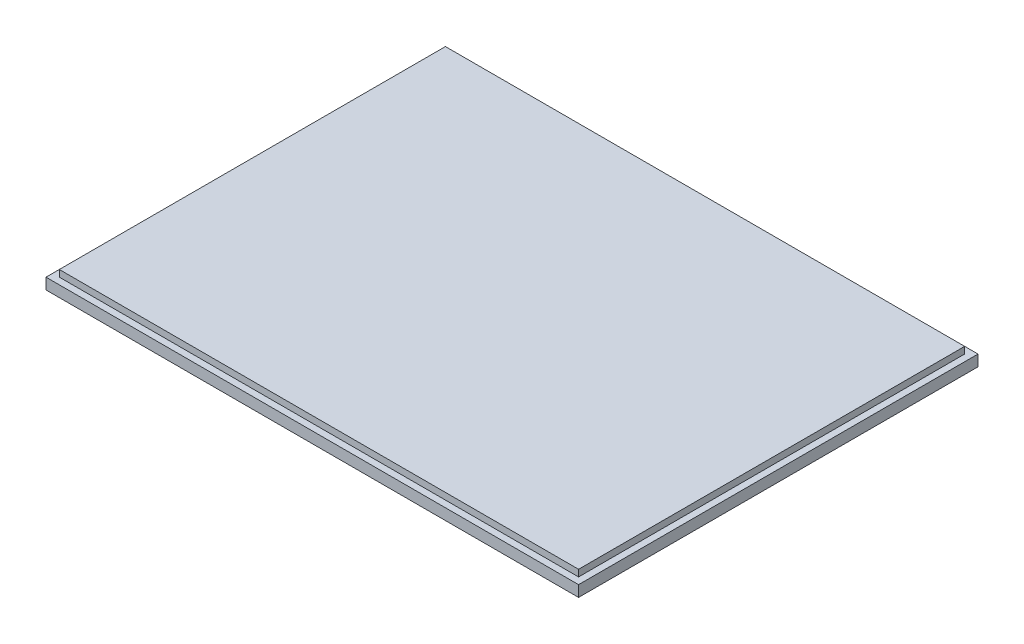
ISO-10303-21;
HEADER;
FILE_DESCRIPTION(('STEP AP214'),'2;1');
FILE_NAME('part.step','',(''),(''),'','','');
FILE_SCHEMA(('AUTOMOTIVE_DESIGN { 1 0 10303 214 1 1 1 1 }'));
ENDSEC;
DATA;
#1=APPLICATION_CONTEXT('core data for automotive mechanical design processes');
#2=APPLICATION_PROTOCOL_DEFINITION('international standard','automotive_design',2000,#1);
#3=PRODUCT_CONTEXT('',#1,'mechanical');
#4=PRODUCT('Part','Part','',(#3));
#5=PRODUCT_RELATED_PRODUCT_CATEGORY('part','',(#4));
#6=PRODUCT_DEFINITION_FORMATION('','',#4);
#7=PRODUCT_DEFINITION_CONTEXT('part definition',#1,'design');
#8=PRODUCT_DEFINITION('design','',#6,#7);
#9=PRODUCT_DEFINITION_SHAPE('','',#8);
#10=(LENGTH_UNIT() NAMED_UNIT(*) SI_UNIT(.MILLI.,.METRE.));
#11=(NAMED_UNIT(*) PLANE_ANGLE_UNIT() SI_UNIT($,.RADIAN.));
#12=(NAMED_UNIT(*) SI_UNIT($,.STERADIAN.) SOLID_ANGLE_UNIT());
#13=UNCERTAINTY_MEASURE_WITH_UNIT(LENGTH_MEASURE(1.E-05),#10,'distance_accuracy_value','');
#14=(GEOMETRIC_REPRESENTATION_CONTEXT(3) GLOBAL_UNCERTAINTY_ASSIGNED_CONTEXT((#13)) GLOBAL_UNIT_ASSIGNED_CONTEXT((#10,
#11,#12)) REPRESENTATION_CONTEXT('',''));
#15=CARTESIAN_POINT('',(0.,0.,0.));
#16=DIRECTION('',(0.,0.,1.));
#17=DIRECTION('',(1.,0.,0.));
#18=AXIS2_PLACEMENT_3D('',#15,#16,#17);
#19=CARTESIAN_POINT('',(60.,4.,-45.));
#20=DIRECTION('',(-1.,0.,0.));
#21=DIRECTION('',(0.,0.,1.));
#22=AXIS2_PLACEMENT_3D('',#19,#20,#21);
#23=PLANE('',#22);
#24=DIRECTION('',(0.,0.,-1.));
#25=VECTOR('',#24,1.);
#26=CARTESIAN_POINT('',(60.,2.5,-45.));
#27=LINE('',#26,#25);
#28=CARTESIAN_POINT('',(60.,2.5,45.));
#29=VERTEX_POINT('',#28);
#30=CARTESIAN_POINT('',(60.,2.5,-45.));
#31=VERTEX_POINT('',#30);
#32=EDGE_CURVE('E144',#29,#31,#27,.T.);
#33=ORIENTED_EDGE('',*,*,#32,.F.);
#34=DIRECTION('',(0.,-1.,0.));
#35=VECTOR('',#34,1.);
#36=CARTESIAN_POINT('',(60.,4.,45.));
#37=LINE('',#36,#35);
#38=CARTESIAN_POINT('',(60.,0.,45.));
#39=VERTEX_POINT('',#38);
#40=EDGE_CURVE('E158',#29,#39,#37,.T.);
#41=ORIENTED_EDGE('',*,*,#40,.T.);
#42=DIRECTION('',(0.,0.,-1.));
#43=VECTOR('',#42,1.);
#44=CARTESIAN_POINT('',(60.,0.,-45.));
#45=LINE('',#44,#43);
#46=CARTESIAN_POINT('',(60.,0.,-45.));
#47=VERTEX_POINT('',#46);
#48=EDGE_CURVE('E146',#39,#47,#45,.T.);
#49=ORIENTED_EDGE('',*,*,#48,.T.);
#50=DIRECTION('',(0.,-1.,0.));
#51=VECTOR('',#50,1.);
#52=CARTESIAN_POINT('',(60.,4.,-45.));
#53=LINE('',#52,#51);
#54=EDGE_CURVE('E45',#31,#47,#53,.T.);
#55=ORIENTED_EDGE('',*,*,#54,.F.);
#56=EDGE_LOOP('',(#33,#41,#49,#55));
#57=FACE_BOUND('',#56,.T.);
#58=ADVANCED_FACE('F38',(#57),#23,.F.);
#59=CARTESIAN_POINT('',(-60.,4.,-45.));
#60=DIRECTION('',(0.,0.,1.));
#61=DIRECTION('',(1.,0.,0.));
#62=AXIS2_PLACEMENT_3D('',#59,#60,#61);
#63=PLANE('',#62);
#64=DIRECTION('',(-1.,0.,0.));
#65=VECTOR('',#64,1.);
#66=CARTESIAN_POINT('',(-60.,2.5,-45.));
#67=LINE('',#66,#65);
#68=CARTESIAN_POINT('',(-60.,2.5,-45.));
#69=VERTEX_POINT('',#68);
#70=EDGE_CURVE('E142',#31,#69,#67,.T.);
#71=ORIENTED_EDGE('',*,*,#70,.F.);
#72=ORIENTED_EDGE('',*,*,#54,.T.);
#73=DIRECTION('',(-1.,0.,0.));
#74=VECTOR('',#73,1.);
#75=CARTESIAN_POINT('',(-60.,0.,-45.));
#76=LINE('',#75,#74);
#77=CARTESIAN_POINT('',(-60.,0.,-45.));
#78=VERTEX_POINT('',#77);
#79=EDGE_CURVE('E149',#47,#78,#76,.T.);
#80=ORIENTED_EDGE('',*,*,#79,.T.);
#81=DIRECTION('',(0.,-1.,0.));
#82=VECTOR('',#81,1.);
#83=CARTESIAN_POINT('',(-60.,4.,-45.));
#84=LINE('',#83,#82);
#85=EDGE_CURVE('E162',#69,#78,#84,.T.);
#86=ORIENTED_EDGE('',*,*,#85,.F.);
#87=EDGE_LOOP('',(#71,#72,#80,#86));
#88=FACE_BOUND('',#87,.T.);
#89=ADVANCED_FACE('F167',(#88),#63,.F.);
#90=CARTESIAN_POINT('',(-60.,4.,-45.));
#91=DIRECTION('',(1.,0.,0.));
#92=DIRECTION('',(0.,0.,-1.));
#93=AXIS2_PLACEMENT_3D('',#90,#91,#92);
#94=PLANE('',#93);
#95=DIRECTION('',(0.,0.,1.));
#96=VECTOR('',#95,1.);
#97=CARTESIAN_POINT('',(-60.,2.5,-45.));
#98=LINE('',#97,#96);
#99=CARTESIAN_POINT('',(-60.,2.5,45.));
#100=VERTEX_POINT('',#99);
#101=EDGE_CURVE('E51',#69,#100,#98,.T.);
#102=ORIENTED_EDGE('',*,*,#101,.F.);
#103=ORIENTED_EDGE('',*,*,#85,.T.);
#104=DIRECTION('',(0.,0.,1.));
#105=VECTOR('',#104,1.);
#106=CARTESIAN_POINT('',(-60.,0.,-45.));
#107=LINE('',#106,#105);
#108=CARTESIAN_POINT('',(-60.,0.,45.));
#109=VERTEX_POINT('',#108);
#110=EDGE_CURVE('E152',#78,#109,#107,.T.);
#111=ORIENTED_EDGE('',*,*,#110,.T.);
#112=DIRECTION('',(0.,-1.,0.));
#113=VECTOR('',#112,1.);
#114=CARTESIAN_POINT('',(-60.,4.,45.));
#115=LINE('',#114,#113);
#116=EDGE_CURVE('E160',#100,#109,#115,.T.);
#117=ORIENTED_EDGE('',*,*,#116,.F.);
#118=EDGE_LOOP('',(#102,#103,#111,#117));
#119=FACE_BOUND('',#118,.T.);
#120=ADVANCED_FACE('F181',(#119),#94,.F.);
#121=CARTESIAN_POINT('',(-60.,4.,45.));
#122=DIRECTION('',(0.,0.,-1.));
#123=DIRECTION('',(-1.,0.,0.));
#124=AXIS2_PLACEMENT_3D('',#121,#122,#123);
#125=PLANE('',#124);
#126=DIRECTION('',(1.,0.,0.));
#127=VECTOR('',#126,1.);
#128=CARTESIAN_POINT('',(-60.,2.5,45.));
#129=LINE('',#128,#127);
#130=EDGE_CURVE('E12',#100,#29,#129,.T.);
#131=ORIENTED_EDGE('',*,*,#130,.F.);
#132=ORIENTED_EDGE('',*,*,#116,.T.);
#133=DIRECTION('',(1.,0.,0.));
#134=VECTOR('',#133,1.);
#135=CARTESIAN_POINT('',(-60.,0.,45.));
#136=LINE('',#135,#134);
#137=EDGE_CURVE('E155',#109,#39,#136,.T.);
#138=ORIENTED_EDGE('',*,*,#137,.T.);
#139=ORIENTED_EDGE('',*,*,#40,.F.);
#140=EDGE_LOOP('',(#131,#132,#138,#139));
#141=FACE_BOUND('',#140,.T.);
#142=ADVANCED_FACE('F178',(#141),#125,.F.);
#143=CARTESIAN_POINT('',(0.,0.,0.));
#144=DIRECTION('',(0.,1.,0.));
#145=DIRECTION('',(0.,0.,1.));
#146=AXIS2_PLACEMENT_3D('',#143,#144,#145);
#147=PLANE('',#146);
#148=ORIENTED_EDGE('',*,*,#48,.F.);
#149=ORIENTED_EDGE('',*,*,#137,.F.);
#150=ORIENTED_EDGE('',*,*,#110,.F.);
#151=ORIENTED_EDGE('',*,*,#79,.F.);
#152=EDGE_LOOP('',(#148,#149,#150,#151));
#153=FACE_BOUND('',#152,.T.);
#154=ADVANCED_FACE('F174',(#153),#147,.F.);
#155=CARTESIAN_POINT('',(0.,2.5,0.));
#156=DIRECTION('',(0.,1.,0.));
#157=DIRECTION('',(0.,0.,1.));
#158=AXIS2_PLACEMENT_3D('',#155,#156,#157);
#159=PLANE('',#158);
#160=DIRECTION('',(1.,0.,0.));
#161=VECTOR('',#160,1.);
#162=CARTESIAN_POINT('',(-58.5,2.5,43.5));
#163=LINE('',#162,#161);
#164=CARTESIAN_POINT('',(-58.5,2.5,43.5));
#165=VERTEX_POINT('',#164);
#166=CARTESIAN_POINT('',(58.5,2.5,43.5));
#167=VERTEX_POINT('',#166);
#168=EDGE_CURVE('E113',#165,#167,#163,.T.);
#169=ORIENTED_EDGE('',*,*,#168,.F.);
#170=DIRECTION('',(0.,0.,1.));
#171=VECTOR('',#170,1.);
#172=CARTESIAN_POINT('',(-58.5,2.5,-43.5));
#173=LINE('',#172,#171);
#174=CARTESIAN_POINT('',(-58.5,2.5,-43.5));
#175=VERTEX_POINT('',#174);
#176=EDGE_CURVE('E122',#175,#165,#173,.T.);
#177=ORIENTED_EDGE('',*,*,#176,.F.);
#178=DIRECTION('',(-1.,0.,0.));
#179=VECTOR('',#178,1.);
#180=CARTESIAN_POINT('',(-58.5,2.5,-43.5));
#181=LINE('',#180,#179);
#182=CARTESIAN_POINT('',(58.5,2.5,-43.5));
#183=VERTEX_POINT('',#182);
#184=EDGE_CURVE('E105',#183,#175,#181,.T.);
#185=ORIENTED_EDGE('',*,*,#184,.F.);
#186=DIRECTION('',(0.,0.,-1.));
#187=VECTOR('',#186,1.);
#188=CARTESIAN_POINT('',(58.5,2.5,-43.5));
#189=LINE('',#188,#187);
#190=EDGE_CURVE('E119',#167,#183,#189,.T.);
#191=ORIENTED_EDGE('',*,*,#190,.F.);
#192=EDGE_LOOP('',(#169,#177,#185,#191));
#193=FACE_BOUND('',#192,.T.);
#194=ORIENTED_EDGE('',*,*,#32,.T.);
#195=ORIENTED_EDGE('',*,*,#70,.T.);
#196=ORIENTED_EDGE('',*,*,#101,.T.);
#197=ORIENTED_EDGE('',*,*,#130,.T.);
#198=EDGE_LOOP('',(#194,#195,#196,#197));
#199=FACE_BOUND('',#198,.T.);
#200=ADVANCED_FACE('F118',(#193,#199),#159,.T.);
#201=CARTESIAN_POINT('',(58.5,2.5,-43.5));
#202=DIRECTION('',(1.,0.,0.));
#203=DIRECTION('',(0.,0.,-1.));
#204=AXIS2_PLACEMENT_3D('',#201,#202,#203);
#205=PLANE('',#204);
#206=DIRECTION('',(0.,0.,-1.));
#207=VECTOR('',#206,1.);
#208=CARTESIAN_POINT('',(58.5,4.,-43.5));
#209=LINE('',#208,#207);
#210=CARTESIAN_POINT('',(58.5,4.,43.5));
#211=VERTEX_POINT('',#210);
#212=CARTESIAN_POINT('',(58.5,4.,-43.5));
#213=VERTEX_POINT('',#212);
#214=EDGE_CURVE('E133',#211,#213,#209,.T.);
#215=ORIENTED_EDGE('',*,*,#214,.F.);
#216=DIRECTION('',(0.,1.,0.));
#217=VECTOR('',#216,1.);
#218=CARTESIAN_POINT('',(58.5,2.5,43.5));
#219=LINE('',#218,#217);
#220=EDGE_CURVE('E125',#167,#211,#219,.T.);
#221=ORIENTED_EDGE('',*,*,#220,.F.);
#222=ORIENTED_EDGE('',*,*,#190,.T.);
#223=DIRECTION('',(0.,1.,0.));
#224=VECTOR('',#223,1.);
#225=CARTESIAN_POINT('',(58.5,2.5,-43.5));
#226=LINE('',#225,#224);
#227=EDGE_CURVE('E102',#183,#213,#226,.T.);
#228=ORIENTED_EDGE('',*,*,#227,.T.);
#229=EDGE_LOOP('',(#215,#221,#222,#228));
#230=FACE_BOUND('',#229,.T.);
#231=ADVANCED_FACE('F124',(#230),#205,.T.);
#232=CARTESIAN_POINT('',(-58.5,2.5,43.5));
#233=DIRECTION('',(0.,0.,1.));
#234=DIRECTION('',(1.,0.,0.));
#235=AXIS2_PLACEMENT_3D('',#232,#233,#234);
#236=PLANE('',#235);
#237=DIRECTION('',(1.,0.,0.));
#238=VECTOR('',#237,1.);
#239=CARTESIAN_POINT('',(-58.5,4.,43.5));
#240=LINE('',#239,#238);
#241=CARTESIAN_POINT('',(-58.5,4.,43.5));
#242=VERTEX_POINT('',#241);
#243=EDGE_CURVE('E126',#242,#211,#240,.T.);
#244=ORIENTED_EDGE('',*,*,#243,.F.);
#245=DIRECTION('',(0.,1.,0.));
#246=VECTOR('',#245,1.);
#247=CARTESIAN_POINT('',(-58.5,2.5,43.5));
#248=LINE('',#247,#246);
#249=EDGE_CURVE('E138',#165,#242,#248,.T.);
#250=ORIENTED_EDGE('',*,*,#249,.F.);
#251=ORIENTED_EDGE('',*,*,#168,.T.);
#252=ORIENTED_EDGE('',*,*,#220,.T.);
#253=EDGE_LOOP('',(#244,#250,#251,#252));
#254=FACE_BOUND('',#253,.T.);
#255=ADVANCED_FACE('F226',(#254),#236,.T.);
#256=CARTESIAN_POINT('',(-58.5,2.5,-43.5));
#257=DIRECTION('',(-1.,0.,0.));
#258=DIRECTION('',(0.,0.,1.));
#259=AXIS2_PLACEMENT_3D('',#256,#257,#258);
#260=PLANE('',#259);
#261=DIRECTION('',(0.,0.,1.));
#262=VECTOR('',#261,1.);
#263=CARTESIAN_POINT('',(-58.5,4.,-43.5));
#264=LINE('',#263,#262);
#265=CARTESIAN_POINT('',(-58.5,4.,-43.5));
#266=VERTEX_POINT('',#265);
#267=EDGE_CURVE('E59',#266,#242,#264,.T.);
#268=ORIENTED_EDGE('',*,*,#267,.F.);
#269=DIRECTION('',(0.,1.,0.));
#270=VECTOR('',#269,1.);
#271=CARTESIAN_POINT('',(-58.5,2.5,-43.5));
#272=LINE('',#271,#270);
#273=EDGE_CURVE('E112',#175,#266,#272,.T.);
#274=ORIENTED_EDGE('',*,*,#273,.F.);
#275=ORIENTED_EDGE('',*,*,#176,.T.);
#276=ORIENTED_EDGE('',*,*,#249,.T.);
#277=EDGE_LOOP('',(#268,#274,#275,#276));
#278=FACE_BOUND('',#277,.T.);
#279=ADVANCED_FACE('F235',(#278),#260,.T.);
#280=CARTESIAN_POINT('',(-58.5,2.5,-43.5));
#281=DIRECTION('',(0.,0.,-1.));
#282=DIRECTION('',(-1.,0.,0.));
#283=AXIS2_PLACEMENT_3D('',#280,#281,#282);
#284=PLANE('',#283);
#285=DIRECTION('',(-1.,0.,0.));
#286=VECTOR('',#285,1.);
#287=CARTESIAN_POINT('',(-58.5,4.,-43.5));
#288=LINE('',#287,#286);
#289=EDGE_CURVE('E107',#213,#266,#288,.T.);
#290=ORIENTED_EDGE('',*,*,#289,.F.);
#291=ORIENTED_EDGE('',*,*,#227,.F.);
#292=ORIENTED_EDGE('',*,*,#184,.T.);
#293=ORIENTED_EDGE('',*,*,#273,.T.);
#294=EDGE_LOOP('',(#290,#291,#292,#293));
#295=FACE_BOUND('',#294,.T.);
#296=ADVANCED_FACE('F104',(#295),#284,.T.);
#297=CARTESIAN_POINT('',(0.,4.,0.));
#298=DIRECTION('',(0.,1.,0.));
#299=DIRECTION('',(0.,0.,1.));
#300=AXIS2_PLACEMENT_3D('',#297,#298,#299);
#301=PLANE('',#300);
#302=ORIENTED_EDGE('',*,*,#243,.T.);
#303=ORIENTED_EDGE('',*,*,#214,.T.);
#304=ORIENTED_EDGE('',*,*,#289,.T.);
#305=ORIENTED_EDGE('',*,*,#267,.T.);
#306=EDGE_LOOP('',(#302,#303,#304,#305));
#307=FACE_BOUND('',#306,.T.);
#308=ADVANCED_FACE('F253',(#307),#301,.T.);
#309=CLOSED_SHELL('',(#58,#89,#120,#142,#154,#200,#231,#255,#279,#296,#308));
#310=MANIFOLD_SOLID_BREP('B2',#309);
#311=ADVANCED_BREP_SHAPE_REPRESENTATION('',(#18,#310),#14);
#312=SHAPE_DEFINITION_REPRESENTATION(#9,#311);
ENDSEC;
END-ISO-10303-21;
